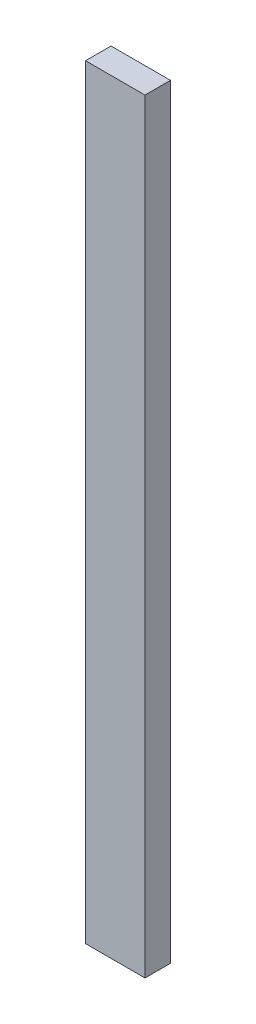
ISO-10303-21;
HEADER;
FILE_DESCRIPTION(('STEP AP214'),'2;1');
FILE_NAME('part.step','',(''),(''),'','','');
FILE_SCHEMA(('AUTOMOTIVE_DESIGN { 1 0 10303 214 1 1 1 1 }'));
ENDSEC;
DATA;
#1=APPLICATION_CONTEXT('core data for automotive mechanical design processes');
#2=APPLICATION_PROTOCOL_DEFINITION('international standard','automotive_design',2000,#1);
#3=PRODUCT_CONTEXT('',#1,'mechanical');
#4=PRODUCT('Part','Part','',(#3));
#5=PRODUCT_RELATED_PRODUCT_CATEGORY('part','',(#4));
#6=PRODUCT_DEFINITION_FORMATION('','',#4);
#7=PRODUCT_DEFINITION_CONTEXT('part definition',#1,'design');
#8=PRODUCT_DEFINITION('design','',#6,#7);
#9=PRODUCT_DEFINITION_SHAPE('','',#8);
#10=(LENGTH_UNIT() NAMED_UNIT(*) SI_UNIT(.MILLI.,.METRE.));
#11=(NAMED_UNIT(*) PLANE_ANGLE_UNIT() SI_UNIT($,.RADIAN.));
#12=(NAMED_UNIT(*) SI_UNIT($,.STERADIAN.) SOLID_ANGLE_UNIT());
#13=UNCERTAINTY_MEASURE_WITH_UNIT(LENGTH_MEASURE(1.E-05),#10,'distance_accuracy_value','');
#14=(GEOMETRIC_REPRESENTATION_CONTEXT(3) GLOBAL_UNCERTAINTY_ASSIGNED_CONTEXT((#13)) GLOBAL_UNIT_ASSIGNED_CONTEXT((#10,
#11,#12)) REPRESENTATION_CONTEXT('',''));
#15=CARTESIAN_POINT('',(0.,0.,0.));
#16=DIRECTION('',(0.,0.,1.));
#17=DIRECTION('',(1.,0.,0.));
#18=AXIS2_PLACEMENT_3D('',#15,#16,#17);
#19=CARTESIAN_POINT('',(-44.45,1143.,19.05));
#20=DIRECTION('',(-1.,0.,0.));
#21=DIRECTION('',(0.,0.,1.));
#22=AXIS2_PLACEMENT_3D('',#19,#20,#21);
#23=PLANE('',#22);
#24=DIRECTION('',(0.,0.,-1.));
#25=VECTOR('',#24,1.);
#26=CARTESIAN_POINT('',(-44.45,0.,19.05));
#27=LINE('',#26,#25);
#28=CARTESIAN_POINT('',(-44.45,0.,19.05));
#29=VERTEX_POINT('',#28);
#30=CARTESIAN_POINT('',(-44.45,0.,-19.05));
#31=VERTEX_POINT('',#30);
#32=EDGE_CURVE('E104',#29,#31,#27,.T.);
#33=ORIENTED_EDGE('',*,*,#32,.F.);
#34=DIRECTION('',(0.,-1.,0.));
#35=VECTOR('',#34,1.);
#36=CARTESIAN_POINT('',(-44.45,1143.,19.05));
#37=LINE('',#36,#35);
#38=CARTESIAN_POINT('',(-44.45,1143.,19.05));
#39=VERTEX_POINT('',#38);
#40=EDGE_CURVE('E11',#39,#29,#37,.T.);
#41=ORIENTED_EDGE('',*,*,#40,.F.);
#42=DIRECTION('',(0.,0.,-1.));
#43=VECTOR('',#42,1.);
#44=CARTESIAN_POINT('',(-44.45,1143.,19.05));
#45=LINE('',#44,#43);
#46=CARTESIAN_POINT('',(-44.45,1143.,-19.05));
#47=VERTEX_POINT('',#46);
#48=EDGE_CURVE('E99',#39,#47,#45,.T.);
#49=ORIENTED_EDGE('',*,*,#48,.T.);
#50=DIRECTION('',(0.,-1.,0.));
#51=VECTOR('',#50,1.);
#52=CARTESIAN_POINT('',(-44.45,1143.,-19.05));
#53=LINE('',#52,#51);
#54=EDGE_CURVE('E42',#47,#31,#53,.T.);
#55=ORIENTED_EDGE('',*,*,#54,.T.);
#56=EDGE_LOOP('',(#33,#41,#49,#55));
#57=FACE_BOUND('',#56,.T.);
#58=ADVANCED_FACE('F39',(#57),#23,.T.);
#59=CARTESIAN_POINT('',(-44.45,1143.,19.05));
#60=DIRECTION('',(0.,0.,-1.));
#61=DIRECTION('',(-1.,0.,0.));
#62=AXIS2_PLACEMENT_3D('',#59,#60,#61);
#63=PLANE('',#62);
#64=DIRECTION('',(1.,0.,0.));
#65=VECTOR('',#64,1.);
#66=CARTESIAN_POINT('',(-44.45,0.,19.05));
#67=LINE('',#66,#65);
#68=CARTESIAN_POINT('',(44.45,0.,19.05));
#69=VERTEX_POINT('',#68);
#70=EDGE_CURVE('E72',#29,#69,#67,.T.);
#71=ORIENTED_EDGE('',*,*,#70,.T.);
#72=DIRECTION('',(0.,-1.,0.));
#73=VECTOR('',#72,1.);
#74=CARTESIAN_POINT('',(44.45,1143.,19.05));
#75=LINE('',#74,#73);
#76=CARTESIAN_POINT('',(44.45,1143.,19.05));
#77=VERTEX_POINT('',#76);
#78=EDGE_CURVE('E48',#77,#69,#75,.T.);
#79=ORIENTED_EDGE('',*,*,#78,.F.);
#80=DIRECTION('',(1.,0.,0.));
#81=VECTOR('',#80,1.);
#82=CARTESIAN_POINT('',(-44.45,1143.,19.05));
#83=LINE('',#82,#81);
#84=EDGE_CURVE('E89',#39,#77,#83,.T.);
#85=ORIENTED_EDGE('',*,*,#84,.F.);
#86=ORIENTED_EDGE('',*,*,#40,.T.);
#87=EDGE_LOOP('',(#71,#79,#85,#86));
#88=FACE_BOUND('',#87,.T.);
#89=ADVANCED_FACE('F114',(#88),#63,.F.);
#90=CARTESIAN_POINT('',(44.45,1143.,19.05));
#91=DIRECTION('',(-1.,0.,0.));
#92=DIRECTION('',(0.,0.,1.));
#93=AXIS2_PLACEMENT_3D('',#90,#91,#92);
#94=PLANE('',#93);
#95=DIRECTION('',(0.,0.,-1.));
#96=VECTOR('',#95,1.);
#97=CARTESIAN_POINT('',(44.45,0.,19.05));
#98=LINE('',#97,#96);
#99=CARTESIAN_POINT('',(44.45,0.,-19.05));
#100=VERTEX_POINT('',#99);
#101=EDGE_CURVE('E96',#69,#100,#98,.T.);
#102=ORIENTED_EDGE('',*,*,#101,.T.);
#103=DIRECTION('',(0.,-1.,0.));
#104=VECTOR('',#103,1.);
#105=CARTESIAN_POINT('',(44.45,1143.,-19.05));
#106=LINE('',#105,#104);
#107=CARTESIAN_POINT('',(44.45,1143.,-19.05));
#108=VERTEX_POINT('',#107);
#109=EDGE_CURVE('E93',#108,#100,#106,.T.);
#110=ORIENTED_EDGE('',*,*,#109,.F.);
#111=DIRECTION('',(0.,0.,-1.));
#112=VECTOR('',#111,1.);
#113=CARTESIAN_POINT('',(44.45,1143.,19.05));
#114=LINE('',#113,#112);
#115=EDGE_CURVE('E84',#77,#108,#114,.T.);
#116=ORIENTED_EDGE('',*,*,#115,.F.);
#117=ORIENTED_EDGE('',*,*,#78,.T.);
#118=EDGE_LOOP('',(#102,#110,#116,#117));
#119=FACE_BOUND('',#118,.T.);
#120=ADVANCED_FACE('F94',(#119),#94,.F.);
#121=CARTESIAN_POINT('',(-44.45,1143.,-19.05));
#122=DIRECTION('',(0.,0.,-1.));
#123=DIRECTION('',(-1.,0.,0.));
#124=AXIS2_PLACEMENT_3D('',#121,#122,#123);
#125=PLANE('',#124);
#126=DIRECTION('',(1.,0.,0.));
#127=VECTOR('',#126,1.);
#128=CARTESIAN_POINT('',(-44.45,0.,-19.05));
#129=LINE('',#128,#127);
#130=EDGE_CURVE('E107',#31,#100,#129,.T.);
#131=ORIENTED_EDGE('',*,*,#130,.F.);
#132=ORIENTED_EDGE('',*,*,#54,.F.);
#133=DIRECTION('',(1.,0.,0.));
#134=VECTOR('',#133,1.);
#135=CARTESIAN_POINT('',(-44.45,1143.,-19.05));
#136=LINE('',#135,#134);
#137=EDGE_CURVE('E88',#47,#108,#136,.T.);
#138=ORIENTED_EDGE('',*,*,#137,.T.);
#139=ORIENTED_EDGE('',*,*,#109,.T.);
#140=EDGE_LOOP('',(#131,#132,#138,#139));
#141=FACE_BOUND('',#140,.T.);
#142=ADVANCED_FACE('F98',(#141),#125,.T.);
#143=CARTESIAN_POINT('',(0.,1143.,0.));
#144=DIRECTION('',(0.,-1.,0.));
#145=DIRECTION('',(0.,0.,-1.));
#146=AXIS2_PLACEMENT_3D('',#143,#144,#145);
#147=PLANE('',#146);
#148=ORIENTED_EDGE('',*,*,#48,.F.);
#149=ORIENTED_EDGE('',*,*,#84,.T.);
#150=ORIENTED_EDGE('',*,*,#115,.T.);
#151=ORIENTED_EDGE('',*,*,#137,.F.);
#152=EDGE_LOOP('',(#148,#149,#150,#151));
#153=FACE_BOUND('',#152,.T.);
#154=ADVANCED_FACE('F87',(#153),#147,.F.);
#155=CARTESIAN_POINT('',(0.,0.,0.));
#156=DIRECTION('',(0.,-1.,0.));
#157=DIRECTION('',(0.,0.,-1.));
#158=AXIS2_PLACEMENT_3D('',#155,#156,#157);
#159=PLANE('',#158);
#160=ORIENTED_EDGE('',*,*,#32,.T.);
#161=ORIENTED_EDGE('',*,*,#130,.T.);
#162=ORIENTED_EDGE('',*,*,#101,.F.);
#163=ORIENTED_EDGE('',*,*,#70,.F.);
#164=EDGE_LOOP('',(#160,#161,#162,#163));
#165=FACE_BOUND('',#164,.T.);
#166=ADVANCED_FACE('F112',(#165),#159,.T.);
#167=CLOSED_SHELL('',(#58,#89,#120,#142,#154,#166));
#168=MANIFOLD_SOLID_BREP('B2',#167);
#169=ADVANCED_BREP_SHAPE_REPRESENTATION('',(#18,#168),#14);
#170=SHAPE_DEFINITION_REPRESENTATION(#9,#169);
ENDSEC;
END-ISO-10303-21;
